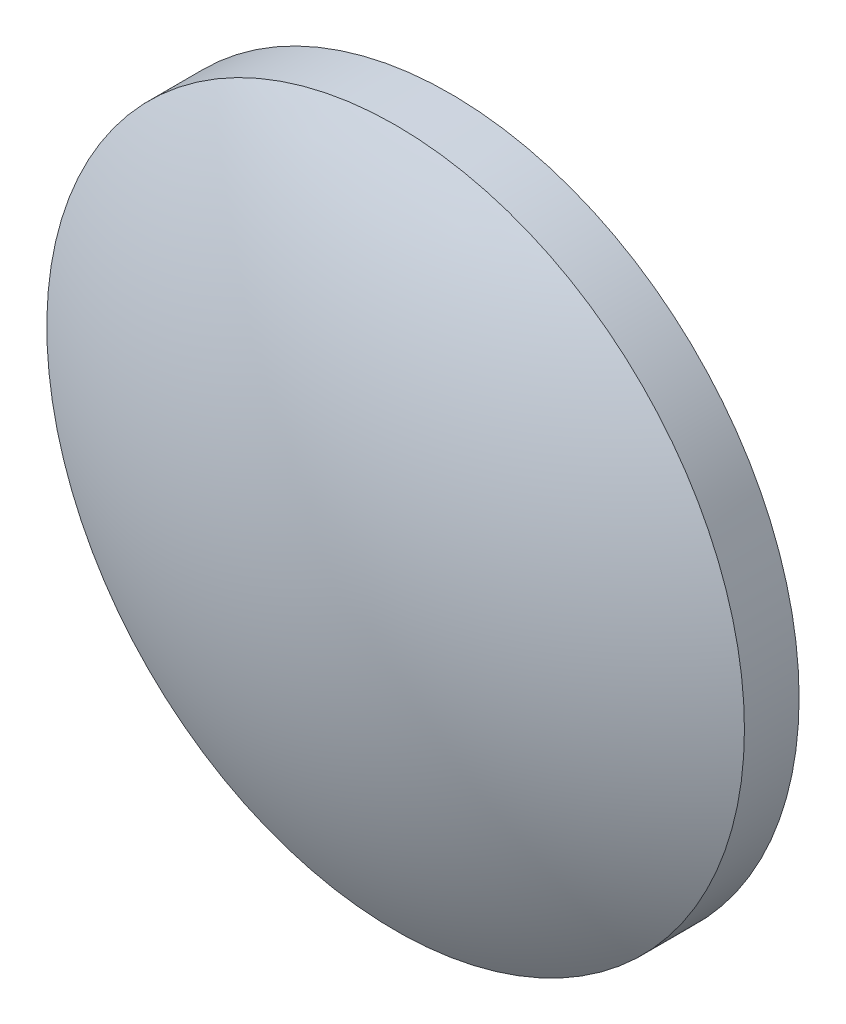
ISO-10303-21;
HEADER;
FILE_DESCRIPTION(('STEP AP214'),'2;1');
FILE_NAME('part.step','',(''),(''),'','','');
FILE_SCHEMA(('AUTOMOTIVE_DESIGN { 1 0 10303 214 1 1 1 1 }'));
ENDSEC;
DATA;
#1=APPLICATION_CONTEXT('core data for automotive mechanical design processes');
#2=APPLICATION_PROTOCOL_DEFINITION('international standard','automotive_design',2000,#1);
#3=PRODUCT_CONTEXT('',#1,'mechanical');
#4=PRODUCT('Part','Part','',(#3));
#5=PRODUCT_RELATED_PRODUCT_CATEGORY('part','',(#4));
#6=PRODUCT_DEFINITION_FORMATION('','',#4);
#7=PRODUCT_DEFINITION_CONTEXT('part definition',#1,'design');
#8=PRODUCT_DEFINITION('design','',#6,#7);
#9=PRODUCT_DEFINITION_SHAPE('','',#8);
#10=(LENGTH_UNIT() NAMED_UNIT(*) SI_UNIT(.MILLI.,.METRE.));
#11=(NAMED_UNIT(*) PLANE_ANGLE_UNIT() SI_UNIT($,.RADIAN.));
#12=(NAMED_UNIT(*) SI_UNIT($,.STERADIAN.) SOLID_ANGLE_UNIT());
#13=UNCERTAINTY_MEASURE_WITH_UNIT(LENGTH_MEASURE(1.E-05),#10,'distance_accuracy_value','');
#14=(GEOMETRIC_REPRESENTATION_CONTEXT(3) GLOBAL_UNCERTAINTY_ASSIGNED_CONTEXT((#13)) GLOBAL_UNIT_ASSIGNED_CONTEXT((#10,
#11,#12)) REPRESENTATION_CONTEXT('',''));
#15=CARTESIAN_POINT('',(0.,0.,0.));
#16=DIRECTION('',(0.,0.,1.));
#17=DIRECTION('',(1.,0.,0.));
#18=AXIS2_PLACEMENT_3D('',#15,#16,#17);
#19=CARTESIAN_POINT('',(0.,0.,-23.08));
#20=DIRECTION('',(0.,0.,1.));
#21=DIRECTION('',(0.,1.,0.));
#22=AXIS2_PLACEMENT_3D('',#19,#20,#21);
#23=SPHERICAL_SURFACE('',#22,25.75);
#24=CARTESIAN_POINT('',(0.,0.,-0.679720983880581));
#25=DIRECTION('',(0.,0.,1.));
#26=DIRECTION('',(1.,0.,0.));
#27=AXIS2_PLACEMENT_3D('',#24,#25,#26);
#28=CIRCLE('',#27,12.7);
#29=CARTESIAN_POINT('',(12.7,0.,-0.679720983880581));
#30=VERTEX_POINT('',#29);
#31=EDGE_CURVE('E10',#30,#30,#28,.T.);
#32=ORIENTED_EDGE('',*,*,#31,.T.);
#33=EDGE_LOOP('',(#32));
#34=FACE_BOUND('',#33,.T.);
#35=ADVANCED_FACE('F14',(#34),#23,.T.);
#36=CARTESIAN_POINT('',(0.,0.,4.30813204540037));
#37=DIRECTION('',(0.,0.,1.));
#38=DIRECTION('',(1.,0.,0.));
#39=AXIS2_PLACEMENT_3D('',#36,#37,#38);
#40=CYLINDRICAL_SURFACE('',#39,12.7);
#41=ORIENTED_EDGE('',*,*,#31,.F.);
#42=EDGE_LOOP('',(#41));
#43=FACE_BOUND('',#42,.T.);
#44=CARTESIAN_POINT('',(0.,0.,-2.67));
#45=DIRECTION('',(0.,0.,1.));
#46=DIRECTION('',(1.,0.,0.));
#47=AXIS2_PLACEMENT_3D('',#44,#45,#46);
#48=CIRCLE('',#47,12.7);
#49=CARTESIAN_POINT('',(12.7,0.,-2.67));
#50=VERTEX_POINT('',#49);
#51=EDGE_CURVE('E20',#50,#50,#48,.T.);
#52=ORIENTED_EDGE('',*,*,#51,.T.);
#53=EDGE_LOOP('',(#52));
#54=FACE_BOUND('',#53,.T.);
#55=ADVANCED_FACE('F26',(#43,#54),#40,.T.);
#56=CARTESIAN_POINT('',(0.,0.,-2.67));
#57=DIRECTION('',(0.,0.,1.));
#58=DIRECTION('',(1.,0.,0.));
#59=AXIS2_PLACEMENT_3D('',#56,#57,#58);
#60=PLANE('',#59);
#61=ORIENTED_EDGE('',*,*,#51,.F.);
#62=EDGE_LOOP('',(#61));
#63=FACE_BOUND('',#62,.T.);
#64=ADVANCED_FACE('F28',(#63),#60,.F.);
#65=CLOSED_SHELL('',(#35,#55,#64));
#66=MANIFOLD_SOLID_BREP('B1',#65);
#67=ADVANCED_BREP_SHAPE_REPRESENTATION('',(#18,#66),#14);
#68=SHAPE_DEFINITION_REPRESENTATION(#9,#67);
ENDSEC;
END-ISO-10303-21;
